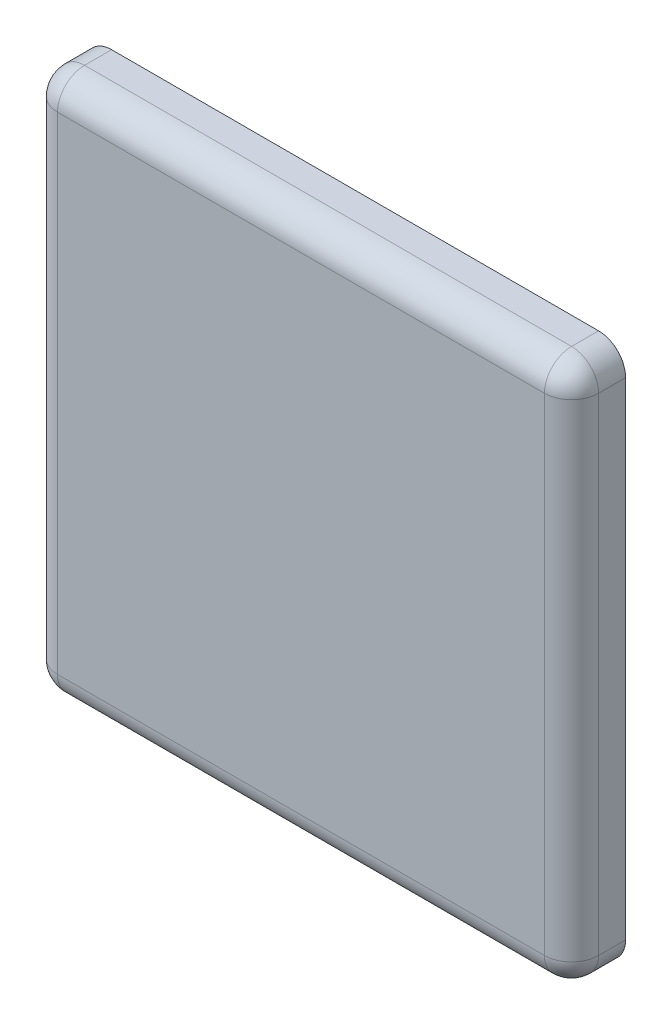
ISO-10303-21;
HEADER;
FILE_DESCRIPTION(('STEP AP214'),'2;1');
FILE_NAME('part.step','',(''),(''),'','','');
FILE_SCHEMA(('AUTOMOTIVE_DESIGN { 1 0 10303 214 1 1 1 1 }'));
ENDSEC;
DATA;
#1=APPLICATION_CONTEXT('core data for automotive mechanical design processes');
#2=APPLICATION_PROTOCOL_DEFINITION('international standard','automotive_design',2000,#1);
#3=PRODUCT_CONTEXT('',#1,'mechanical');
#4=PRODUCT('Part','Part','',(#3));
#5=PRODUCT_RELATED_PRODUCT_CATEGORY('part','',(#4));
#6=PRODUCT_DEFINITION_FORMATION('','',#4);
#7=PRODUCT_DEFINITION_CONTEXT('part definition',#1,'design');
#8=PRODUCT_DEFINITION('design','',#6,#7);
#9=PRODUCT_DEFINITION_SHAPE('','',#8);
#10=(LENGTH_UNIT() NAMED_UNIT(*) SI_UNIT(.MILLI.,.METRE.));
#11=(NAMED_UNIT(*) PLANE_ANGLE_UNIT() SI_UNIT($,.RADIAN.));
#12=(NAMED_UNIT(*) SI_UNIT($,.STERADIAN.) SOLID_ANGLE_UNIT());
#13=UNCERTAINTY_MEASURE_WITH_UNIT(LENGTH_MEASURE(1.E-05),#10,'distance_accuracy_value','');
#14=(GEOMETRIC_REPRESENTATION_CONTEXT(3) GLOBAL_UNCERTAINTY_ASSIGNED_CONTEXT((#13)) GLOBAL_UNIT_ASSIGNED_CONTEXT((#10,
#11,#12)) REPRESENTATION_CONTEXT('',''));
#15=CARTESIAN_POINT('',(0.,0.,0.));
#16=DIRECTION('',(0.,0.,1.));
#17=DIRECTION('',(1.,0.,0.));
#18=AXIS2_PLACEMENT_3D('',#15,#16,#17);
#19=CARTESIAN_POINT('',(0.,0.,2.));
#20=DIRECTION('',(1.,0.,0.));
#21=DIRECTION('',(0.,1.,0.));
#22=AXIS2_PLACEMENT_3D('',#19,#20,#21);
#23=PLANE('',#22);
#24=DIRECTION('',(0.,-1.,0.));
#25=VECTOR('',#24,1.);
#26=CARTESIAN_POINT('',(0.,0.,0.));
#27=LINE('',#26,#25);
#28=CARTESIAN_POINT('',(0.,19.,0.));
#29=VERTEX_POINT('',#28);
#30=CARTESIAN_POINT('',(0.,1.,0.));
#31=VERTEX_POINT('',#30);
#32=EDGE_CURVE('E141',#29,#31,#27,.T.);
#33=ORIENTED_EDGE('',*,*,#32,.T.);
#34=DIRECTION('',(0.,0.,-1.));
#35=VECTOR('',#34,1.);
#36=CARTESIAN_POINT('',(0.,1.,2.));
#37=LINE('',#36,#35);
#38=CARTESIAN_POINT('',(0.,1.,1.));
#39=VERTEX_POINT('',#38);
#40=EDGE_CURVE('E159',#31,#39,#37,.F.);
#41=ORIENTED_EDGE('',*,*,#40,.T.);
#42=DIRECTION('',(0.,-1.,0.));
#43=VECTOR('',#42,1.);
#44=CARTESIAN_POINT('',(0.,0.,1.));
#45=LINE('',#44,#43);
#46=CARTESIAN_POINT('',(0.,19.,1.));
#47=VERTEX_POINT('',#46);
#48=EDGE_CURVE('E155',#39,#47,#45,.F.);
#49=ORIENTED_EDGE('',*,*,#48,.T.);
#50=DIRECTION('',(0.,0.,-1.));
#51=VECTOR('',#50,1.);
#52=CARTESIAN_POINT('',(0.,19.,2.));
#53=LINE('',#52,#51);
#54=EDGE_CURVE('E157',#47,#29,#53,.T.);
#55=ORIENTED_EDGE('',*,*,#54,.T.);
#56=EDGE_LOOP('',(#33,#41,#49,#55));
#57=FACE_BOUND('',#56,.T.);
#58=ADVANCED_FACE('F32',(#57),#23,.F.);
#59=CARTESIAN_POINT('',(0.,0.,2.));
#60=DIRECTION('',(0.,1.,0.));
#61=DIRECTION('',(0.,0.,1.));
#62=AXIS2_PLACEMENT_3D('',#59,#60,#61);
#63=PLANE('',#62);
#64=DIRECTION('',(1.,0.,0.));
#65=VECTOR('',#64,1.);
#66=CARTESIAN_POINT('',(0.,0.,0.));
#67=LINE('',#66,#65);
#68=CARTESIAN_POINT('',(1.,0.,0.));
#69=VERTEX_POINT('',#68);
#70=CARTESIAN_POINT('',(19.,0.,0.));
#71=VERTEX_POINT('',#70);
#72=EDGE_CURVE('E137',#69,#71,#67,.T.);
#73=ORIENTED_EDGE('',*,*,#72,.T.);
#74=DIRECTION('',(0.,0.,-1.));
#75=VECTOR('',#74,1.);
#76=CARTESIAN_POINT('',(19.,0.,2.));
#77=LINE('',#76,#75);
#78=CARTESIAN_POINT('',(19.,0.,1.));
#79=VERTEX_POINT('',#78);
#80=EDGE_CURVE('E114',#71,#79,#77,.F.);
#81=ORIENTED_EDGE('',*,*,#80,.T.);
#82=DIRECTION('',(1.,0.,0.));
#83=VECTOR('',#82,1.);
#84=CARTESIAN_POINT('',(0.,0.,1.));
#85=LINE('',#84,#83);
#86=CARTESIAN_POINT('',(1.,0.,1.));
#87=VERTEX_POINT('',#86);
#88=EDGE_CURVE('E119',#79,#87,#85,.F.);
#89=ORIENTED_EDGE('',*,*,#88,.T.);
#90=DIRECTION('',(0.,0.,-1.));
#91=VECTOR('',#90,1.);
#92=CARTESIAN_POINT('',(1.,0.,2.));
#93=LINE('',#92,#91);
#94=EDGE_CURVE('E152',#87,#69,#93,.T.);
#95=ORIENTED_EDGE('',*,*,#94,.T.);
#96=EDGE_LOOP('',(#73,#81,#89,#95));
#97=FACE_BOUND('',#96,.T.);
#98=ADVANCED_FACE('F248',(#97),#63,.F.);
#99=CARTESIAN_POINT('',(20.,0.,2.));
#100=DIRECTION('',(-1.,0.,0.));
#101=DIRECTION('',(0.,-1.,0.));
#102=AXIS2_PLACEMENT_3D('',#99,#100,#101);
#103=PLANE('',#102);
#104=DIRECTION('',(0.,1.,0.));
#105=VECTOR('',#104,1.);
#106=CARTESIAN_POINT('',(20.,0.,1.));
#107=LINE('',#106,#105);
#108=CARTESIAN_POINT('',(20.,19.,1.));
#109=VERTEX_POINT('',#108);
#110=CARTESIAN_POINT('',(20.,1.,1.));
#111=VERTEX_POINT('',#110);
#112=EDGE_CURVE('E128',#109,#111,#107,.F.);
#113=ORIENTED_EDGE('',*,*,#112,.T.);
#114=DIRECTION('',(0.,0.,-1.));
#115=VECTOR('',#114,1.);
#116=CARTESIAN_POINT('',(20.,1.,2.));
#117=LINE('',#116,#115);
#118=CARTESIAN_POINT('',(20.,1.,0.));
#119=VERTEX_POINT('',#118);
#120=EDGE_CURVE('E113',#111,#119,#117,.T.);
#121=ORIENTED_EDGE('',*,*,#120,.T.);
#122=DIRECTION('',(0.,1.,0.));
#123=VECTOR('',#122,1.);
#124=CARTESIAN_POINT('',(20.,0.,0.));
#125=LINE('',#124,#123);
#126=CARTESIAN_POINT('',(20.,19.,0.));
#127=VERTEX_POINT('',#126);
#128=EDGE_CURVE('E125',#119,#127,#125,.T.);
#129=ORIENTED_EDGE('',*,*,#128,.T.);
#130=DIRECTION('',(0.,0.,-1.));
#131=VECTOR('',#130,1.);
#132=CARTESIAN_POINT('',(20.,19.,2.));
#133=LINE('',#132,#131);
#134=EDGE_CURVE('E131',#127,#109,#133,.F.);
#135=ORIENTED_EDGE('',*,*,#134,.T.);
#136=EDGE_LOOP('',(#113,#121,#129,#135));
#137=FACE_BOUND('',#136,.T.);
#138=ADVANCED_FACE('F124',(#137),#103,.F.);
#139=CARTESIAN_POINT('',(0.,20.,2.));
#140=DIRECTION('',(0.,-1.,0.));
#141=DIRECTION('',(0.,0.,-1.));
#142=AXIS2_PLACEMENT_3D('',#139,#140,#141);
#143=PLANE('',#142);
#144=DIRECTION('',(-1.,0.,0.));
#145=VECTOR('',#144,1.);
#146=CARTESIAN_POINT('',(0.,20.,0.));
#147=LINE('',#146,#145);
#148=CARTESIAN_POINT('',(19.,20.,0.));
#149=VERTEX_POINT('',#148);
#150=CARTESIAN_POINT('',(0.99999999999999,20.,0.));
#151=VERTEX_POINT('',#150);
#152=EDGE_CURVE('E136',#149,#151,#147,.T.);
#153=ORIENTED_EDGE('',*,*,#152,.T.);
#154=DIRECTION('',(0.,0.,-1.));
#155=VECTOR('',#154,1.);
#156=CARTESIAN_POINT('',(0.99999999999999,20.,2.));
#157=LINE('',#156,#155);
#158=CARTESIAN_POINT('',(0.99999999999999,20.,1.));
#159=VERTEX_POINT('',#158);
#160=EDGE_CURVE('E165',#151,#159,#157,.F.);
#161=ORIENTED_EDGE('',*,*,#160,.T.);
#162=DIRECTION('',(-1.,0.,0.));
#163=VECTOR('',#162,1.);
#164=CARTESIAN_POINT('',(0.,20.,1.));
#165=LINE('',#164,#163);
#166=CARTESIAN_POINT('',(19.,20.,1.));
#167=VERTEX_POINT('',#166);
#168=EDGE_CURVE('E161',#159,#167,#165,.F.);
#169=ORIENTED_EDGE('',*,*,#168,.T.);
#170=DIRECTION('',(0.,0.,-1.));
#171=VECTOR('',#170,1.);
#172=CARTESIAN_POINT('',(19.,20.,2.));
#173=LINE('',#172,#171);
#174=EDGE_CURVE('E163',#167,#149,#173,.T.);
#175=ORIENTED_EDGE('',*,*,#174,.T.);
#176=EDGE_LOOP('',(#153,#161,#169,#175));
#177=FACE_BOUND('',#176,.T.);
#178=ADVANCED_FACE('F225',(#177),#143,.F.);
#179=CARTESIAN_POINT('',(0.,20.,2.));
#180=DIRECTION('',(0.,0.,-1.));
#181=DIRECTION('',(-1.,0.,0.));
#182=AXIS2_PLACEMENT_3D('',#179,#180,#181);
#183=PLANE('',#182);
#184=DIRECTION('',(1.,0.,0.));
#185=VECTOR('',#184,1.);
#186=CARTESIAN_POINT('',(0.,1.,2.));
#187=LINE('',#186,#185);
#188=CARTESIAN_POINT('',(1.,1.,2.));
#189=VERTEX_POINT('',#188);
#190=CARTESIAN_POINT('',(19.,1.,2.));
#191=VERTEX_POINT('',#190);
#192=EDGE_CURVE('E41',#189,#191,#187,.T.);
#193=ORIENTED_EDGE('',*,*,#192,.T.);
#194=DIRECTION('',(0.,1.,0.));
#195=VECTOR('',#194,1.);
#196=CARTESIAN_POINT('',(19.,20.,2.));
#197=LINE('',#196,#195);
#198=CARTESIAN_POINT('',(19.,19.,2.));
#199=VERTEX_POINT('',#198);
#200=EDGE_CURVE('E11',#191,#199,#197,.T.);
#201=ORIENTED_EDGE('',*,*,#200,.T.);
#202=DIRECTION('',(-1.,0.,0.));
#203=VECTOR('',#202,1.);
#204=CARTESIAN_POINT('',(0.,19.,2.));
#205=LINE('',#204,#203);
#206=CARTESIAN_POINT('',(0.99999999999999,19.,2.));
#207=VERTEX_POINT('',#206);
#208=EDGE_CURVE('E167',#199,#207,#205,.T.);
#209=ORIENTED_EDGE('',*,*,#208,.T.);
#210=DIRECTION('',(0.,-1.,0.));
#211=VECTOR('',#210,1.);
#212=CARTESIAN_POINT('',(0.99999999999999,20.,2.));
#213=LINE('',#212,#211);
#214=EDGE_CURVE('E52',#207,#189,#213,.T.);
#215=ORIENTED_EDGE('',*,*,#214,.T.);
#216=EDGE_LOOP('',(#193,#201,#209,#215));
#217=FACE_BOUND('',#216,.T.);
#218=ADVANCED_FACE('F286',(#217),#183,.F.);
#219=CARTESIAN_POINT('',(0.,20.,0.));
#220=DIRECTION('',(0.,0.,-1.));
#221=DIRECTION('',(-1.,0.,0.));
#222=AXIS2_PLACEMENT_3D('',#219,#220,#221);
#223=PLANE('',#222);
#224=ORIENTED_EDGE('',*,*,#128,.F.);
#225=CARTESIAN_POINT('',(19.,1.,0.));
#226=DIRECTION('',(0.,0.,-1.));
#227=DIRECTION('',(-1.,0.,0.));
#228=AXIS2_PLACEMENT_3D('',#225,#226,#227);
#229=CIRCLE('',#228,1.);
#230=EDGE_CURVE('E109',#119,#71,#229,.T.);
#231=ORIENTED_EDGE('',*,*,#230,.T.);
#232=ORIENTED_EDGE('',*,*,#72,.F.);
#233=CARTESIAN_POINT('',(1.,1.,0.));
#234=DIRECTION('',(0.,0.,-1.));
#235=DIRECTION('',(-1.,0.,0.));
#236=AXIS2_PLACEMENT_3D('',#233,#234,#235);
#237=CIRCLE('',#236,1.);
#238=EDGE_CURVE('E120',#69,#31,#237,.T.);
#239=ORIENTED_EDGE('',*,*,#238,.T.);
#240=ORIENTED_EDGE('',*,*,#32,.F.);
#241=CARTESIAN_POINT('',(0.99999999999999,19.,0.));
#242=DIRECTION('',(0.,0.,-1.));
#243=DIRECTION('',(-1.,0.,0.));
#244=AXIS2_PLACEMENT_3D('',#241,#242,#243);
#245=CIRCLE('',#244,1.);
#246=EDGE_CURVE('E148',#29,#151,#245,.T.);
#247=ORIENTED_EDGE('',*,*,#246,.T.);
#248=ORIENTED_EDGE('',*,*,#152,.F.);
#249=CARTESIAN_POINT('',(19.,19.,0.));
#250=DIRECTION('',(0.,0.,-1.));
#251=DIRECTION('',(-1.,0.,0.));
#252=AXIS2_PLACEMENT_3D('',#249,#250,#251);
#253=CIRCLE('',#252,1.);
#254=EDGE_CURVE('E130',#149,#127,#253,.T.);
#255=ORIENTED_EDGE('',*,*,#254,.T.);
#256=EDGE_LOOP('',(#224,#231,#232,#239,#240,#247,#248,#255));
#257=FACE_BOUND('',#256,.T.);
#258=ADVANCED_FACE('F133',(#257),#223,.T.);
#259=CARTESIAN_POINT('',(0.99999999999999,19.,2.));
#260=DIRECTION('',(0.,0.,-1.));
#261=DIRECTION('',(-1.,0.,0.));
#262=AXIS2_PLACEMENT_3D('',#259,#260,#261);
#263=CYLINDRICAL_SURFACE('',#262,1.);
#264=CARTESIAN_POINT('',(0.99999999999999,19.,1.));
#265=DIRECTION('',(0.,0.,1.));
#266=DIRECTION('',(1.,0.,0.));
#267=AXIS2_PLACEMENT_3D('',#264,#265,#266);
#268=CIRCLE('',#267,1.);
#269=EDGE_CURVE('E36',#159,#47,#268,.T.);
#270=ORIENTED_EDGE('',*,*,#269,.F.);
#271=ORIENTED_EDGE('',*,*,#160,.F.);
#272=ORIENTED_EDGE('',*,*,#246,.F.);
#273=ORIENTED_EDGE('',*,*,#54,.F.);
#274=EDGE_LOOP('',(#270,#271,#272,#273));
#275=FACE_BOUND('',#274,.T.);
#276=ADVANCED_FACE('F34',(#275),#263,.T.);
#277=CARTESIAN_POINT('',(0.99999999999999,19.,1.));
#278=DIRECTION('',(0.,0.,1.));
#279=DIRECTION('',(1.,0.,0.));
#280=AXIS2_PLACEMENT_3D('',#277,#278,#279);
#281=SPHERICAL_SURFACE('',#280,1.);
#282=CARTESIAN_POINT('',(0.99999999999999,19.,1.));
#283=DIRECTION('',(-1.,0.,0.));
#284=DIRECTION('',(0.,0.,1.));
#285=AXIS2_PLACEMENT_3D('',#282,#283,#284);
#286=CIRCLE('',#285,1.);
#287=EDGE_CURVE('E196',#159,#207,#286,.F.);
#288=ORIENTED_EDGE('',*,*,#287,.F.);
#289=ORIENTED_EDGE('',*,*,#269,.T.);
#290=CARTESIAN_POINT('',(0.99999999999999,19.,1.));
#291=DIRECTION('',(0.,1.,0.));
#292=DIRECTION('',(0.,0.,1.));
#293=AXIS2_PLACEMENT_3D('',#290,#291,#292);
#294=CIRCLE('',#293,1.);
#295=EDGE_CURVE('E198',#207,#47,#294,.F.);
#296=ORIENTED_EDGE('',*,*,#295,.F.);
#297=EDGE_LOOP('',(#288,#289,#296));
#298=FACE_BOUND('',#297,.T.);
#299=ADVANCED_FACE('F278',(#298),#281,.T.);
#300=CARTESIAN_POINT('',(1.,1.,2.));
#301=DIRECTION('',(0.,0.,-1.));
#302=DIRECTION('',(-1.,0.,0.));
#303=AXIS2_PLACEMENT_3D('',#300,#301,#302);
#304=CYLINDRICAL_SURFACE('',#303,1.);
#305=ORIENTED_EDGE('',*,*,#238,.F.);
#306=ORIENTED_EDGE('',*,*,#94,.F.);
#307=CARTESIAN_POINT('',(1.,1.,1.));
#308=DIRECTION('',(0.,0.,1.));
#309=DIRECTION('',(1.,0.,0.));
#310=AXIS2_PLACEMENT_3D('',#307,#308,#309);
#311=CIRCLE('',#310,1.);
#312=EDGE_CURVE('E193',#39,#87,#311,.T.);
#313=ORIENTED_EDGE('',*,*,#312,.F.);
#314=ORIENTED_EDGE('',*,*,#40,.F.);
#315=EDGE_LOOP('',(#305,#306,#313,#314));
#316=FACE_BOUND('',#315,.T.);
#317=ADVANCED_FACE('F216',(#316),#304,.T.);
#318=CARTESIAN_POINT('',(0.99999999999999,20.,1.));
#319=DIRECTION('',(0.,-1.,0.));
#320=DIRECTION('',(1.,0.,0.));
#321=AXIS2_PLACEMENT_3D('',#318,#319,#320);
#322=CYLINDRICAL_SURFACE('',#321,1.);
#323=ORIENTED_EDGE('',*,*,#295,.T.);
#324=ORIENTED_EDGE('',*,*,#48,.F.);
#325=CARTESIAN_POINT('',(1.,1.,1.));
#326=DIRECTION('',(0.,-1.,0.));
#327=DIRECTION('',(1.,0.,0.));
#328=AXIS2_PLACEMENT_3D('',#325,#326,#327);
#329=CIRCLE('',#328,1.);
#330=EDGE_CURVE('E190',#189,#39,#329,.T.);
#331=ORIENTED_EDGE('',*,*,#330,.F.);
#332=ORIENTED_EDGE('',*,*,#214,.F.);
#333=EDGE_LOOP('',(#323,#324,#331,#332));
#334=FACE_BOUND('',#333,.T.);
#335=ADVANCED_FACE('F221',(#334),#322,.T.);
#336=CARTESIAN_POINT('',(0.,19.,1.));
#337=DIRECTION('',(-1.,0.,0.));
#338=DIRECTION('',(0.,0.,1.));
#339=AXIS2_PLACEMENT_3D('',#336,#337,#338);
#340=CYLINDRICAL_SURFACE('',#339,1.);
#341=ORIENTED_EDGE('',*,*,#287,.T.);
#342=ORIENTED_EDGE('',*,*,#208,.F.);
#343=CARTESIAN_POINT('',(19.,19.,1.));
#344=DIRECTION('',(1.,0.,0.));
#345=DIRECTION('',(0.,0.,-1.));
#346=AXIS2_PLACEMENT_3D('',#343,#344,#345);
#347=CIRCLE('',#346,1.);
#348=EDGE_CURVE('E187',#167,#199,#347,.T.);
#349=ORIENTED_EDGE('',*,*,#348,.F.);
#350=ORIENTED_EDGE('',*,*,#168,.F.);
#351=EDGE_LOOP('',(#341,#342,#349,#350));
#352=FACE_BOUND('',#351,.T.);
#353=ADVANCED_FACE('F235',(#352),#340,.T.);
#354=CARTESIAN_POINT('',(19.,19.,2.));
#355=DIRECTION('',(0.,0.,-1.));
#356=DIRECTION('',(-1.,0.,0.));
#357=AXIS2_PLACEMENT_3D('',#354,#355,#356);
#358=CYLINDRICAL_SURFACE('',#357,1.);
#359=ORIENTED_EDGE('',*,*,#254,.F.);
#360=ORIENTED_EDGE('',*,*,#174,.F.);
#361=CARTESIAN_POINT('',(19.,19.,1.));
#362=DIRECTION('',(0.,0.,1.));
#363=DIRECTION('',(1.,0.,0.));
#364=AXIS2_PLACEMENT_3D('',#361,#362,#363);
#365=CIRCLE('',#364,1.);
#366=EDGE_CURVE('E184',#109,#167,#365,.T.);
#367=ORIENTED_EDGE('',*,*,#366,.F.);
#368=ORIENTED_EDGE('',*,*,#134,.F.);
#369=EDGE_LOOP('',(#359,#360,#367,#368));
#370=FACE_BOUND('',#369,.T.);
#371=ADVANCED_FACE('F231',(#370),#358,.T.);
#372=CARTESIAN_POINT('',(1.,1.,1.));
#373=DIRECTION('',(0.,0.,1.));
#374=DIRECTION('',(1.,0.,0.));
#375=AXIS2_PLACEMENT_3D('',#372,#373,#374);
#376=SPHERICAL_SURFACE('',#375,1.);
#377=ORIENTED_EDGE('',*,*,#330,.T.);
#378=ORIENTED_EDGE('',*,*,#312,.T.);
#379=CARTESIAN_POINT('',(1.,1.,1.));
#380=DIRECTION('',(-1.,0.,0.));
#381=DIRECTION('',(0.,0.,1.));
#382=AXIS2_PLACEMENT_3D('',#379,#380,#381);
#383=CIRCLE('',#382,1.);
#384=EDGE_CURVE('E181',#189,#87,#383,.F.);
#385=ORIENTED_EDGE('',*,*,#384,.F.);
#386=EDGE_LOOP('',(#377,#378,#385));
#387=FACE_BOUND('',#386,.T.);
#388=ADVANCED_FACE('F220',(#387),#376,.T.);
#389=CARTESIAN_POINT('',(19.,19.,1.));
#390=DIRECTION('',(0.,0.,1.));
#391=DIRECTION('',(1.,0.,0.));
#392=AXIS2_PLACEMENT_3D('',#389,#390,#391);
#393=SPHERICAL_SURFACE('',#392,1.);
#394=ORIENTED_EDGE('',*,*,#366,.T.);
#395=ORIENTED_EDGE('',*,*,#348,.T.);
#396=CARTESIAN_POINT('',(19.,19.,1.));
#397=DIRECTION('',(0.,1.,0.));
#398=DIRECTION('',(0.,0.,1.));
#399=AXIS2_PLACEMENT_3D('',#396,#397,#398);
#400=CIRCLE('',#399,1.);
#401=EDGE_CURVE('E179',#109,#199,#400,.F.);
#402=ORIENTED_EDGE('',*,*,#401,.F.);
#403=EDGE_LOOP('',(#394,#395,#402));
#404=FACE_BOUND('',#403,.T.);
#405=ADVANCED_FACE('F237',(#404),#393,.T.);
#406=CARTESIAN_POINT('',(0.,1.,1.));
#407=DIRECTION('',(1.,0.,0.));
#408=DIRECTION('',(0.,0.,-1.));
#409=AXIS2_PLACEMENT_3D('',#406,#407,#408);
#410=CYLINDRICAL_SURFACE('',#409,1.);
#411=ORIENTED_EDGE('',*,*,#384,.T.);
#412=ORIENTED_EDGE('',*,*,#88,.F.);
#413=CARTESIAN_POINT('',(19.,1.,1.));
#414=DIRECTION('',(1.,0.,0.));
#415=DIRECTION('',(0.,0.,-1.));
#416=AXIS2_PLACEMENT_3D('',#413,#414,#415);
#417=CIRCLE('',#416,1.);
#418=EDGE_CURVE('E176',#191,#79,#417,.T.);
#419=ORIENTED_EDGE('',*,*,#418,.F.);
#420=ORIENTED_EDGE('',*,*,#192,.F.);
#421=EDGE_LOOP('',(#411,#412,#419,#420));
#422=FACE_BOUND('',#421,.T.);
#423=ADVANCED_FACE('F246',(#422),#410,.T.);
#424=CARTESIAN_POINT('',(19.,20.,1.));
#425=DIRECTION('',(0.,1.,0.));
#426=DIRECTION('',(-1.,0.,0.));
#427=AXIS2_PLACEMENT_3D('',#424,#425,#426);
#428=CYLINDRICAL_SURFACE('',#427,1.);
#429=ORIENTED_EDGE('',*,*,#401,.T.);
#430=ORIENTED_EDGE('',*,*,#200,.F.);
#431=CARTESIAN_POINT('',(19.,1.,1.));
#432=DIRECTION('',(0.,-1.,0.));
#433=DIRECTION('',(0.,0.,-1.));
#434=AXIS2_PLACEMENT_3D('',#431,#432,#433);
#435=CIRCLE('',#434,1.);
#436=EDGE_CURVE('E173',#111,#191,#435,.T.);
#437=ORIENTED_EDGE('',*,*,#436,.F.);
#438=ORIENTED_EDGE('',*,*,#112,.F.);
#439=EDGE_LOOP('',(#429,#430,#437,#438));
#440=FACE_BOUND('',#439,.T.);
#441=ADVANCED_FACE('F239',(#440),#428,.T.);
#442=CARTESIAN_POINT('',(19.,1.,1.));
#443=DIRECTION('',(0.,0.,1.));
#444=DIRECTION('',(1.,0.,0.));
#445=AXIS2_PLACEMENT_3D('',#442,#443,#444);
#446=SPHERICAL_SURFACE('',#445,1.);
#447=ORIENTED_EDGE('',*,*,#436,.T.);
#448=ORIENTED_EDGE('',*,*,#418,.T.);
#449=CARTESIAN_POINT('',(19.,1.,1.));
#450=DIRECTION('',(0.,0.,1.));
#451=DIRECTION('',(1.,0.,0.));
#452=AXIS2_PLACEMENT_3D('',#449,#450,#451);
#453=CIRCLE('',#452,1.);
#454=EDGE_CURVE('E171',#111,#79,#453,.F.);
#455=ORIENTED_EDGE('',*,*,#454,.F.);
#456=EDGE_LOOP('',(#447,#448,#455));
#457=FACE_BOUND('',#456,.T.);
#458=ADVANCED_FACE('F243',(#457),#446,.T.);
#459=CARTESIAN_POINT('',(19.,1.,2.));
#460=DIRECTION('',(0.,0.,-1.));
#461=DIRECTION('',(-1.,0.,0.));
#462=AXIS2_PLACEMENT_3D('',#459,#460,#461);
#463=CYLINDRICAL_SURFACE('',#462,1.);
#464=ORIENTED_EDGE('',*,*,#454,.T.);
#465=ORIENTED_EDGE('',*,*,#80,.F.);
#466=ORIENTED_EDGE('',*,*,#230,.F.);
#467=ORIENTED_EDGE('',*,*,#120,.F.);
#468=EDGE_LOOP('',(#464,#465,#466,#467));
#469=FACE_BOUND('',#468,.T.);
#470=ADVANCED_FACE('F112',(#469),#463,.T.);
#471=CLOSED_SHELL('',(#58,#98,#138,#178,#218,#258,#276,#299,#317,#335,#353,#371,#388,#405,#423,
#441,#458,#470));
#472=MANIFOLD_SOLID_BREP('B2',#471);
#473=ADVANCED_BREP_SHAPE_REPRESENTATION('',(#18,#472),#14);
#474=SHAPE_DEFINITION_REPRESENTATION(#9,#473);
ENDSEC;
END-ISO-10303-21;
